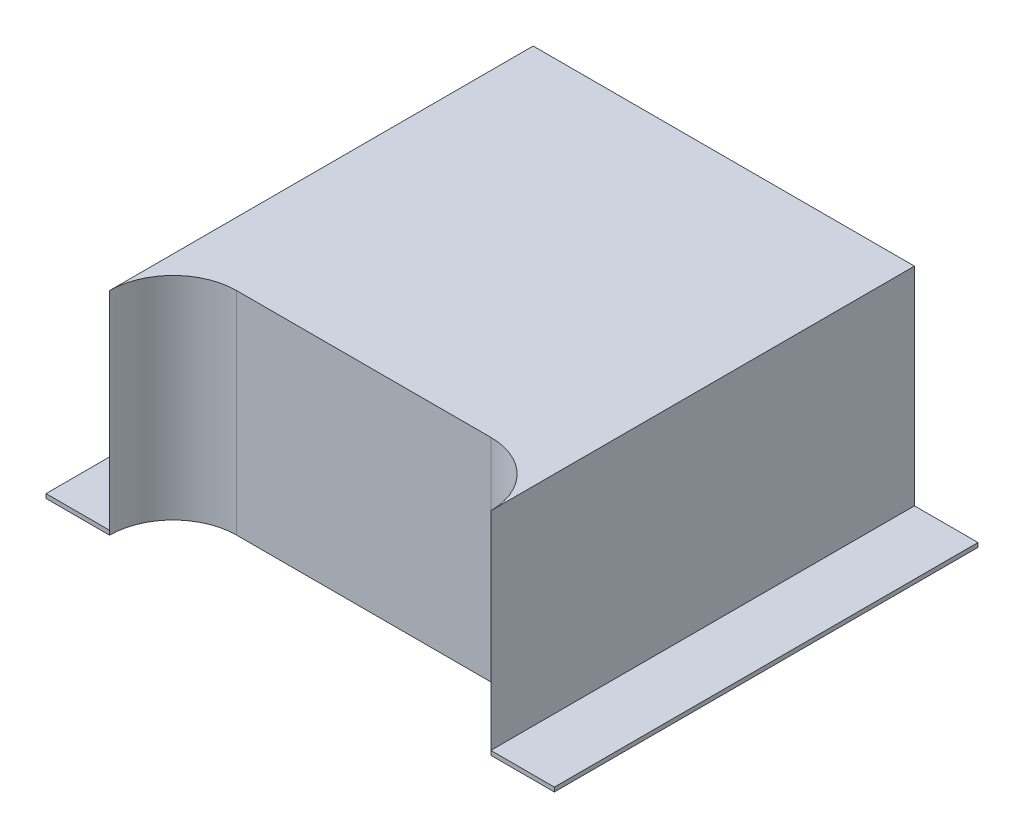
ISO-10303-21;
HEADER;
FILE_DESCRIPTION(('STEP AP214'),'2;1');
FILE_NAME('part.step','',(''),(''),'','','');
FILE_SCHEMA(('AUTOMOTIVE_DESIGN { 1 0 10303 214 1 1 1 1 }'));
ENDSEC;
DATA;
#1=APPLICATION_CONTEXT('core data for automotive mechanical design processes');
#2=APPLICATION_PROTOCOL_DEFINITION('international standard','automotive_design',2000,#1);
#3=PRODUCT_CONTEXT('',#1,'mechanical');
#4=PRODUCT('Part','Part','',(#3));
#5=PRODUCT_RELATED_PRODUCT_CATEGORY('part','',(#4));
#6=PRODUCT_DEFINITION_FORMATION('','',#4);
#7=PRODUCT_DEFINITION_CONTEXT('part definition',#1,'design');
#8=PRODUCT_DEFINITION('design','',#6,#7);
#9=PRODUCT_DEFINITION_SHAPE('','',#8);
#10=(LENGTH_UNIT() NAMED_UNIT(*) SI_UNIT(.MILLI.,.METRE.));
#11=(NAMED_UNIT(*) PLANE_ANGLE_UNIT() SI_UNIT($,.RADIAN.));
#12=(NAMED_UNIT(*) SI_UNIT($,.STERADIAN.) SOLID_ANGLE_UNIT());
#13=UNCERTAINTY_MEASURE_WITH_UNIT(LENGTH_MEASURE(1.E-05),#10,'distance_accuracy_value','');
#14=(GEOMETRIC_REPRESENTATION_CONTEXT(3) GLOBAL_UNCERTAINTY_ASSIGNED_CONTEXT((#13)) GLOBAL_UNIT_ASSIGNED_CONTEXT((#10,
#11,#12)) REPRESENTATION_CONTEXT('',''));
#15=CARTESIAN_POINT('',(0.,0.,0.));
#16=DIRECTION('',(0.,0.,1.));
#17=DIRECTION('',(1.,0.,0.));
#18=AXIS2_PLACEMENT_3D('',#15,#16,#17);
#19=CARTESIAN_POINT('',(0.,0.01,0.));
#20=DIRECTION('',(0.,1.,0.));
#21=DIRECTION('',(0.,0.,1.));
#22=AXIS2_PLACEMENT_3D('',#19,#20,#21);
#23=PLANE('',#22);
#24=DIRECTION('',(-1.,0.,0.));
#25=VECTOR('',#24,1.);
#26=CARTESIAN_POINT('',(1.87,0.01,1.6));
#27=LINE('',#26,#25);
#28=CARTESIAN_POINT('',(1.72,0.01,1.6));
#29=VERTEX_POINT('',#28);
#30=CARTESIAN_POINT('',(1.87,0.01,1.6));
#31=VERTEX_POINT('',#30);
#32=EDGE_CURVE('E168',#29,#31,#27,.F.);
#33=ORIENTED_EDGE('',*,*,#32,.T.);
#34=DIRECTION('',(0.,0.,1.));
#35=VECTOR('',#34,1.);
#36=CARTESIAN_POINT('',(1.87,0.01,0.6));
#37=LINE('',#36,#35);
#38=CARTESIAN_POINT('',(1.87,0.01,0.6));
#39=VERTEX_POINT('',#38);
#40=EDGE_CURVE('E149',#31,#39,#37,.F.);
#41=ORIENTED_EDGE('',*,*,#40,.T.);
#42=DIRECTION('',(1.,0.,0.));
#43=VECTOR('',#42,1.);
#44=CARTESIAN_POINT('',(0.67,0.01,0.6));
#45=LINE('',#44,#43);
#46=CARTESIAN_POINT('',(1.72,0.01,0.6));
#47=VERTEX_POINT('',#46);
#48=EDGE_CURVE('E208',#39,#47,#45,.F.);
#49=ORIENTED_EDGE('',*,*,#48,.T.);
#50=DIRECTION('',(0.,0.,1.));
#51=VECTOR('',#50,1.);
#52=CARTESIAN_POINT('',(1.72,0.01,1.6));
#53=LINE('',#52,#51);
#54=EDGE_CURVE('E156',#47,#29,#53,.T.);
#55=ORIENTED_EDGE('',*,*,#54,.T.);
#56=EDGE_LOOP('',(#33,#41,#49,#55));
#57=FACE_BOUND('',#56,.T.);
#58=ADVANCED_FACE('F17',(#57),#23,.T.);
#59=CARTESIAN_POINT('',(1.72,-3.203513695928,1.6));
#60=DIRECTION('',(-1.,0.,0.));
#61=DIRECTION('',(0.,0.,1.));
#62=AXIS2_PLACEMENT_3D('',#59,#60,#61);
#63=PLANE('',#62);
#64=DIRECTION('',(0.,1.,0.));
#65=VECTOR('',#64,1.);
#66=CARTESIAN_POINT('',(1.72,-1.562049935181,1.6));
#67=LINE('',#66,#65);
#68=CARTESIAN_POINT('',(1.72,0.5,1.6));
#69=VERTEX_POINT('',#68);
#70=EDGE_CURVE('E124',#69,#29,#67,.F.);
#71=ORIENTED_EDGE('',*,*,#70,.T.);
#72=ORIENTED_EDGE('',*,*,#54,.F.);
#73=DIRECTION('',(0.,1.,0.));
#74=VECTOR('',#73,1.);
#75=CARTESIAN_POINT('',(1.72,-1.562049935181,0.6));
#76=LINE('',#75,#74);
#77=CARTESIAN_POINT('',(1.72,0.5,0.6));
#78=VERTEX_POINT('',#77);
#79=EDGE_CURVE('E203',#47,#78,#76,.T.);
#80=ORIENTED_EDGE('',*,*,#79,.T.);
#81=DIRECTION('',(0.,0.,-1.));
#82=VECTOR('',#81,1.);
#83=CARTESIAN_POINT('',(1.72,0.5,1.6));
#84=LINE('',#83,#82);
#85=EDGE_CURVE('E154',#78,#69,#84,.F.);
#86=ORIENTED_EDGE('',*,*,#85,.T.);
#87=EDGE_LOOP('',(#71,#72,#80,#86));
#88=FACE_BOUND('',#87,.T.);
#89=ADVANCED_FACE('F268',(#88),#63,.F.);
#90=CARTESIAN_POINT('',(1.57,0.5,1.6));
#91=DIRECTION('',(0.,-1.,0.));
#92=DIRECTION('',(0.,0.,-1.));
#93=AXIS2_PLACEMENT_3D('',#90,#91,#92);
#94=PLANE('',#93);
#95=DIRECTION('',(0.,0.,-1.));
#96=VECTOR('',#95,1.);
#97=CARTESIAN_POINT('',(0.82,0.5,-1.6));
#98=LINE('',#97,#96);
#99=CARTESIAN_POINT('',(0.82,0.5,0.6));
#100=VERTEX_POINT('',#99);
#101=CARTESIAN_POINT('',(0.82,0.5,1.6));
#102=VERTEX_POINT('',#101);
#103=EDGE_CURVE('E97',#100,#102,#98,.F.);
#104=ORIENTED_EDGE('',*,*,#103,.T.);
#105=CARTESIAN_POINT('',(0.97,0.5,1.6));
#106=DIRECTION('',(0.,1.,0.));
#107=DIRECTION('',(0.,0.,1.));
#108=AXIS2_PLACEMENT_3D('',#105,#106,#107);
#109=CIRCLE('',#108,0.15);
#110=CARTESIAN_POINT('',(0.97,0.5,1.45));
#111=VERTEX_POINT('',#110);
#112=EDGE_CURVE('E20',#102,#111,#109,.F.);
#113=ORIENTED_EDGE('',*,*,#112,.T.);
#114=DIRECTION('',(-1.,0.,0.));
#115=VECTOR('',#114,1.);
#116=CARTESIAN_POINT('',(1.57,0.5,1.45));
#117=LINE('',#116,#115);
#118=CARTESIAN_POINT('',(1.57,0.5,1.45));
#119=VERTEX_POINT('',#118);
#120=EDGE_CURVE('E103',#111,#119,#117,.F.);
#121=ORIENTED_EDGE('',*,*,#120,.T.);
#122=CARTESIAN_POINT('',(1.57,0.5,1.6));
#123=DIRECTION('',(0.,1.,0.));
#124=DIRECTION('',(0.,0.,1.));
#125=AXIS2_PLACEMENT_3D('',#122,#123,#124);
#126=CIRCLE('',#125,0.15);
#127=EDGE_CURVE('E122',#119,#69,#126,.F.);
#128=ORIENTED_EDGE('',*,*,#127,.T.);
#129=ORIENTED_EDGE('',*,*,#85,.F.);
#130=DIRECTION('',(1.,0.,0.));
#131=VECTOR('',#130,1.);
#132=CARTESIAN_POINT('',(0.67,0.5,0.6));
#133=LINE('',#132,#131);
#134=EDGE_CURVE('E199',#78,#100,#133,.F.);
#135=ORIENTED_EDGE('',*,*,#134,.T.);
#136=EDGE_LOOP('',(#104,#113,#121,#128,#129,#135));
#137=FACE_BOUND('',#136,.T.);
#138=ADVANCED_FACE('F113',(#137),#94,.F.);
#139=CARTESIAN_POINT('',(0.82,-3.203513695928,-1.6));
#140=DIRECTION('',(1.,0.,0.));
#141=DIRECTION('',(0.,0.,-1.));
#142=AXIS2_PLACEMENT_3D('',#139,#140,#141);
#143=PLANE('',#142);
#144=DIRECTION('',(0.,1.,0.));
#145=VECTOR('',#144,1.);
#146=CARTESIAN_POINT('',(0.82,-1.562049935181,1.6));
#147=LINE('',#146,#145);
#148=CARTESIAN_POINT('',(0.82,0.01,1.6));
#149=VERTEX_POINT('',#148);
#150=EDGE_CURVE('E117',#149,#102,#147,.T.);
#151=ORIENTED_EDGE('',*,*,#150,.T.);
#152=ORIENTED_EDGE('',*,*,#103,.F.);
#153=DIRECTION('',(0.,1.,0.));
#154=VECTOR('',#153,1.);
#155=CARTESIAN_POINT('',(0.82,-1.562049935181,0.6));
#156=LINE('',#155,#154);
#157=CARTESIAN_POINT('',(0.82,0.01,0.6));
#158=VERTEX_POINT('',#157);
#159=EDGE_CURVE('E165',#100,#158,#156,.F.);
#160=ORIENTED_EDGE('',*,*,#159,.T.);
#161=DIRECTION('',(0.,0.,1.));
#162=VECTOR('',#161,1.);
#163=CARTESIAN_POINT('',(0.82,0.01,0.));
#164=LINE('',#163,#162);
#165=EDGE_CURVE('E160',#149,#158,#164,.F.);
#166=ORIENTED_EDGE('',*,*,#165,.F.);
#167=EDGE_LOOP('',(#151,#152,#160,#166));
#168=FACE_BOUND('',#167,.T.);
#169=ADVANCED_FACE('F261',(#168),#143,.F.);
#170=CARTESIAN_POINT('',(0.,0.01,0.));
#171=DIRECTION('',(0.,1.,0.));
#172=DIRECTION('',(0.,0.,1.));
#173=AXIS2_PLACEMENT_3D('',#170,#171,#172);
#174=PLANE('',#173);
#175=DIRECTION('',(-1.,0.,0.));
#176=VECTOR('',#175,1.);
#177=CARTESIAN_POINT('',(0.82,0.01,1.6));
#178=LINE('',#177,#176);
#179=CARTESIAN_POINT('',(0.67,0.01,1.6));
#180=VERTEX_POINT('',#179);
#181=EDGE_CURVE('E135',#180,#149,#178,.F.);
#182=ORIENTED_EDGE('',*,*,#181,.T.);
#183=ORIENTED_EDGE('',*,*,#165,.T.);
#184=DIRECTION('',(1.,0.,0.));
#185=VECTOR('',#184,1.);
#186=CARTESIAN_POINT('',(0.67,0.01,0.6));
#187=LINE('',#186,#185);
#188=CARTESIAN_POINT('',(0.67,0.01,0.6));
#189=VERTEX_POINT('',#188);
#190=EDGE_CURVE('E143',#158,#189,#187,.F.);
#191=ORIENTED_EDGE('',*,*,#190,.T.);
#192=DIRECTION('',(0.,0.,-1.));
#193=VECTOR('',#192,1.);
#194=CARTESIAN_POINT('',(0.67,0.01,1.6));
#195=LINE('',#194,#193);
#196=EDGE_CURVE('E136',#189,#180,#195,.F.);
#197=ORIENTED_EDGE('',*,*,#196,.T.);
#198=EDGE_LOOP('',(#182,#183,#191,#197));
#199=FACE_BOUND('',#198,.T.);
#200=ADVANCED_FACE('F258',(#199),#174,.T.);
#201=CARTESIAN_POINT('',(0.67,-1.562049935181,1.6));
#202=DIRECTION('',(1.,0.,0.));
#203=DIRECTION('',(0.,0.,-1.));
#204=AXIS2_PLACEMENT_3D('',#201,#202,#203);
#205=PLANE('',#204);
#206=DIRECTION('',(0.,1.,0.));
#207=VECTOR('',#206,1.);
#208=CARTESIAN_POINT('',(0.67,-1.562049935181,0.6));
#209=LINE('',#208,#207);
#210=CARTESIAN_POINT('',(0.67,0.,0.6));
#211=VERTEX_POINT('',#210);
#212=EDGE_CURVE('E146',#189,#211,#209,.F.);
#213=ORIENTED_EDGE('',*,*,#212,.T.);
#214=DIRECTION('',(0.,0.,1.));
#215=VECTOR('',#214,1.);
#216=CARTESIAN_POINT('',(0.67,0.,0.));
#217=LINE('',#216,#215);
#218=CARTESIAN_POINT('',(0.67,0.,1.6));
#219=VERTEX_POINT('',#218);
#220=EDGE_CURVE('E139',#211,#219,#217,.T.);
#221=ORIENTED_EDGE('',*,*,#220,.T.);
#222=DIRECTION('',(0.,1.,0.));
#223=VECTOR('',#222,1.);
#224=CARTESIAN_POINT('',(0.67,-1.562049935181,1.6));
#225=LINE('',#224,#223);
#226=EDGE_CURVE('E132',#219,#180,#225,.T.);
#227=ORIENTED_EDGE('',*,*,#226,.T.);
#228=ORIENTED_EDGE('',*,*,#196,.F.);
#229=EDGE_LOOP('',(#213,#221,#227,#228));
#230=FACE_BOUND('',#229,.T.);
#231=ADVANCED_FACE('F295',(#230),#205,.F.);
#232=CARTESIAN_POINT('',(0.82,-1.562049935181,1.6));
#233=DIRECTION('',(0.,0.,-1.));
#234=DIRECTION('',(-1.,0.,0.));
#235=AXIS2_PLACEMENT_3D('',#232,#233,#234);
#236=PLANE('',#235);
#237=ORIENTED_EDGE('',*,*,#226,.F.);
#238=DIRECTION('',(1.,0.,0.));
#239=VECTOR('',#238,1.);
#240=CARTESIAN_POINT('',(0.,0.,1.6));
#241=LINE('',#240,#239);
#242=CARTESIAN_POINT('',(0.82,0.,1.6));
#243=VERTEX_POINT('',#242);
#244=EDGE_CURVE('E142',#219,#243,#241,.T.);
#245=ORIENTED_EDGE('',*,*,#244,.T.);
#246=DIRECTION('',(0.,1.,0.));
#247=VECTOR('',#246,1.);
#248=CARTESIAN_POINT('',(0.82,-1.562049935181,1.6));
#249=LINE('',#248,#247);
#250=EDGE_CURVE('E111',#243,#149,#249,.T.);
#251=ORIENTED_EDGE('',*,*,#250,.T.);
#252=ORIENTED_EDGE('',*,*,#181,.F.);
#253=EDGE_LOOP('',(#237,#245,#251,#252));
#254=FACE_BOUND('',#253,.T.);
#255=ADVANCED_FACE('F292',(#254),#236,.F.);
#256=CARTESIAN_POINT('',(0.97,-1.562049935181,1.6));
#257=DIRECTION('',(0.,1.,0.));
#258=DIRECTION('',(0.,0.,1.));
#259=AXIS2_PLACEMENT_3D('',#256,#257,#258);
#260=CYLINDRICAL_SURFACE('',#259,0.15);
#261=CARTESIAN_POINT('',(0.97,0.,1.6));
#262=DIRECTION('',(0.,1.,0.));
#263=DIRECTION('',(0.,0.,1.));
#264=AXIS2_PLACEMENT_3D('',#261,#262,#263);
#265=CIRCLE('',#264,0.15);
#266=CARTESIAN_POINT('',(0.97,0.,1.45));
#267=VERTEX_POINT('',#266);
#268=EDGE_CURVE('E121',#243,#267,#265,.F.);
#269=ORIENTED_EDGE('',*,*,#268,.T.);
#270=DIRECTION('',(0.,1.,0.));
#271=VECTOR('',#270,1.);
#272=CARTESIAN_POINT('',(0.97,-1.562049935181,1.45));
#273=LINE('',#272,#271);
#274=EDGE_CURVE('E107',#267,#111,#273,.T.);
#275=ORIENTED_EDGE('',*,*,#274,.T.);
#276=ORIENTED_EDGE('',*,*,#112,.F.);
#277=ORIENTED_EDGE('',*,*,#150,.F.);
#278=ORIENTED_EDGE('',*,*,#250,.F.);
#279=EDGE_LOOP('',(#269,#275,#276,#277,#278));
#280=FACE_BOUND('',#279,.T.);
#281=ADVANCED_FACE('F119',(#280),#260,.F.);
#282=CARTESIAN_POINT('',(1.57,-1.562049935181,1.45));
#283=DIRECTION('',(0.,0.,-1.));
#284=DIRECTION('',(-1.,0.,0.));
#285=AXIS2_PLACEMENT_3D('',#282,#283,#284);
#286=PLANE('',#285);
#287=DIRECTION('',(1.,0.,0.));
#288=VECTOR('',#287,1.);
#289=CARTESIAN_POINT('',(0.,0.,1.45));
#290=LINE('',#289,#288);
#291=CARTESIAN_POINT('',(1.57,0.,1.45));
#292=VERTEX_POINT('',#291);
#293=EDGE_CURVE('E219',#267,#292,#290,.T.);
#294=ORIENTED_EDGE('',*,*,#293,.T.);
#295=DIRECTION('',(0.,1.,0.));
#296=VECTOR('',#295,1.);
#297=CARTESIAN_POINT('',(1.57,-1.562049935181,1.45));
#298=LINE('',#297,#296);
#299=EDGE_CURVE('E109',#292,#119,#298,.T.);
#300=ORIENTED_EDGE('',*,*,#299,.T.);
#301=ORIENTED_EDGE('',*,*,#120,.F.);
#302=ORIENTED_EDGE('',*,*,#274,.F.);
#303=EDGE_LOOP('',(#294,#300,#301,#302));
#304=FACE_BOUND('',#303,.T.);
#305=ADVANCED_FACE('F105',(#304),#286,.F.);
#306=CARTESIAN_POINT('',(1.57,-1.562049935181,1.6));
#307=DIRECTION('',(0.,1.,0.));
#308=DIRECTION('',(0.,0.,1.));
#309=AXIS2_PLACEMENT_3D('',#306,#307,#308);
#310=CYLINDRICAL_SURFACE('',#309,0.15);
#311=CARTESIAN_POINT('',(1.57,0.,1.6));
#312=DIRECTION('',(0.,1.,0.));
#313=DIRECTION('',(0.,0.,1.));
#314=AXIS2_PLACEMENT_3D('',#311,#312,#313);
#315=CIRCLE('',#314,0.15);
#316=CARTESIAN_POINT('',(1.72,0.,1.6));
#317=VERTEX_POINT('',#316);
#318=EDGE_CURVE('E215',#292,#317,#315,.F.);
#319=ORIENTED_EDGE('',*,*,#318,.T.);
#320=DIRECTION('',(0.,1.,0.));
#321=VECTOR('',#320,1.);
#322=CARTESIAN_POINT('',(1.72,-1.562049935181,1.6));
#323=LINE('',#322,#321);
#324=EDGE_CURVE('E171',#317,#29,#323,.T.);
#325=ORIENTED_EDGE('',*,*,#324,.T.);
#326=ORIENTED_EDGE('',*,*,#70,.F.);
#327=ORIENTED_EDGE('',*,*,#127,.F.);
#328=ORIENTED_EDGE('',*,*,#299,.F.);
#329=EDGE_LOOP('',(#319,#325,#326,#327,#328));
#330=FACE_BOUND('',#329,.T.);
#331=ADVANCED_FACE('F263',(#330),#310,.F.);
#332=CARTESIAN_POINT('',(1.87,-1.562049935181,1.6));
#333=DIRECTION('',(0.,0.,-1.));
#334=DIRECTION('',(-1.,0.,0.));
#335=AXIS2_PLACEMENT_3D('',#332,#333,#334);
#336=PLANE('',#335);
#337=ORIENTED_EDGE('',*,*,#324,.F.);
#338=DIRECTION('',(1.,0.,0.));
#339=VECTOR('',#338,1.);
#340=CARTESIAN_POINT('',(0.,0.,1.6));
#341=LINE('',#340,#339);
#342=CARTESIAN_POINT('',(1.87,0.,1.6));
#343=VERTEX_POINT('',#342);
#344=EDGE_CURVE('E218',#317,#343,#341,.T.);
#345=ORIENTED_EDGE('',*,*,#344,.T.);
#346=DIRECTION('',(0.,1.,0.));
#347=VECTOR('',#346,1.);
#348=CARTESIAN_POINT('',(1.87,-1.562049935181,1.6));
#349=LINE('',#348,#347);
#350=EDGE_CURVE('E170',#343,#31,#349,.T.);
#351=ORIENTED_EDGE('',*,*,#350,.T.);
#352=ORIENTED_EDGE('',*,*,#32,.F.);
#353=EDGE_LOOP('',(#337,#345,#351,#352));
#354=FACE_BOUND('',#353,.T.);
#355=ADVANCED_FACE('F243',(#354),#336,.F.);
#356=CARTESIAN_POINT('',(1.87,-1.562049935181,0.6));
#357=DIRECTION('',(-1.,0.,0.));
#358=DIRECTION('',(0.,0.,1.));
#359=AXIS2_PLACEMENT_3D('',#356,#357,#358);
#360=PLANE('',#359);
#361=ORIENTED_EDGE('',*,*,#350,.F.);
#362=DIRECTION('',(0.,0.,1.));
#363=VECTOR('',#362,1.);
#364=CARTESIAN_POINT('',(1.87,0.,0.));
#365=LINE('',#364,#363);
#366=CARTESIAN_POINT('',(1.87,0.,0.6));
#367=VERTEX_POINT('',#366);
#368=EDGE_CURVE('E26',#343,#367,#365,.F.);
#369=ORIENTED_EDGE('',*,*,#368,.T.);
#370=DIRECTION('',(0.,1.,0.));
#371=VECTOR('',#370,1.);
#372=CARTESIAN_POINT('',(1.87,-1.562049935181,0.6));
#373=LINE('',#372,#371);
#374=EDGE_CURVE('E34',#367,#39,#373,.T.);
#375=ORIENTED_EDGE('',*,*,#374,.T.);
#376=ORIENTED_EDGE('',*,*,#40,.F.);
#377=EDGE_LOOP('',(#361,#369,#375,#376));
#378=FACE_BOUND('',#377,.T.);
#379=ADVANCED_FACE('F248',(#378),#360,.F.);
#380=CARTESIAN_POINT('',(0.67,-1.562049935181,0.6));
#381=DIRECTION('',(0.,0.,1.));
#382=DIRECTION('',(1.,0.,0.));
#383=AXIS2_PLACEMENT_3D('',#380,#381,#382);
#384=PLANE('',#383);
#385=ORIENTED_EDGE('',*,*,#159,.F.);
#386=ORIENTED_EDGE('',*,*,#134,.F.);
#387=ORIENTED_EDGE('',*,*,#79,.F.);
#388=ORIENTED_EDGE('',*,*,#48,.F.);
#389=ORIENTED_EDGE('',*,*,#374,.F.);
#390=DIRECTION('',(1.,0.,0.));
#391=VECTOR('',#390,1.);
#392=CARTESIAN_POINT('',(0.,0.,0.6));
#393=LINE('',#392,#391);
#394=EDGE_CURVE('E11',#367,#211,#393,.F.);
#395=ORIENTED_EDGE('',*,*,#394,.T.);
#396=ORIENTED_EDGE('',*,*,#212,.F.);
#397=ORIENTED_EDGE('',*,*,#190,.F.);
#398=EDGE_LOOP('',(#385,#386,#387,#388,#389,#395,#396,#397));
#399=FACE_BOUND('',#398,.T.);
#400=ADVANCED_FACE('F254',(#399),#384,.F.);
#401=CARTESIAN_POINT('',(0.,0.,0.));
#402=DIRECTION('',(0.,1.,0.));
#403=DIRECTION('',(0.,0.,1.));
#404=AXIS2_PLACEMENT_3D('',#401,#402,#403);
#405=PLANE('',#404);
#406=ORIENTED_EDGE('',*,*,#368,.F.);
#407=ORIENTED_EDGE('',*,*,#344,.F.);
#408=ORIENTED_EDGE('',*,*,#318,.F.);
#409=ORIENTED_EDGE('',*,*,#293,.F.);
#410=ORIENTED_EDGE('',*,*,#268,.F.);
#411=ORIENTED_EDGE('',*,*,#244,.F.);
#412=ORIENTED_EDGE('',*,*,#220,.F.);
#413=ORIENTED_EDGE('',*,*,#394,.F.);
#414=EDGE_LOOP('',(#406,#407,#408,#409,#410,#411,#412,#413));
#415=FACE_BOUND('',#414,.T.);
#416=ADVANCED_FACE('F250',(#415),#405,.F.);
#417=CLOSED_SHELL('',(#58,#89,#138,#169,#200,#231,#255,#281,#305,#331,#355,#379,#400,#416));
#418=MANIFOLD_SOLID_BREP('B1',#417);
#419=ADVANCED_BREP_SHAPE_REPRESENTATION('',(#18,#418),#14);
#420=SHAPE_DEFINITION_REPRESENTATION(#9,#419);
ENDSEC;
END-ISO-10303-21;
